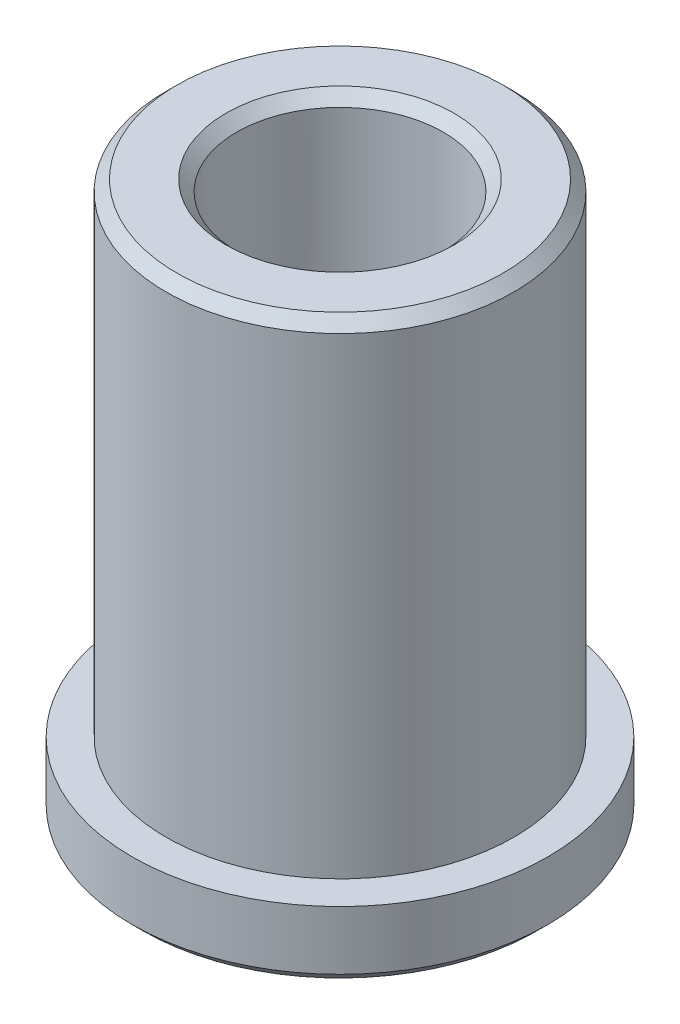
ISO-10303-21;
HEADER;
FILE_DESCRIPTION(('STEP AP214'),'2;1');
FILE_NAME('part.step','',(''),(''),'','','');
FILE_SCHEMA(('AUTOMOTIVE_DESIGN { 1 0 10303 214 1 1 1 1 }'));
ENDSEC;
DATA;
#1=APPLICATION_CONTEXT('core data for automotive mechanical design processes');
#2=APPLICATION_PROTOCOL_DEFINITION('international standard','automotive_design',2000,#1);
#3=PRODUCT_CONTEXT('',#1,'mechanical');
#4=PRODUCT('Part','Part','',(#3));
#5=PRODUCT_RELATED_PRODUCT_CATEGORY('part','',(#4));
#6=PRODUCT_DEFINITION_FORMATION('','',#4);
#7=PRODUCT_DEFINITION_CONTEXT('part definition',#1,'design');
#8=PRODUCT_DEFINITION('design','',#6,#7);
#9=PRODUCT_DEFINITION_SHAPE('','',#8);
#10=(LENGTH_UNIT() NAMED_UNIT(*) SI_UNIT(.MILLI.,.METRE.));
#11=(NAMED_UNIT(*) PLANE_ANGLE_UNIT() SI_UNIT($,.RADIAN.));
#12=(NAMED_UNIT(*) SI_UNIT($,.STERADIAN.) SOLID_ANGLE_UNIT());
#13=UNCERTAINTY_MEASURE_WITH_UNIT(LENGTH_MEASURE(1.E-05),#10,'distance_accuracy_value','');
#14=(GEOMETRIC_REPRESENTATION_CONTEXT(3) GLOBAL_UNCERTAINTY_ASSIGNED_CONTEXT((#13)) GLOBAL_UNIT_ASSIGNED_CONTEXT((#10,
#11,#12)) REPRESENTATION_CONTEXT('',''));
#15=CARTESIAN_POINT('',(0.,0.,0.));
#16=DIRECTION('',(0.,0.,1.));
#17=DIRECTION('',(1.,0.,0.));
#18=AXIS2_PLACEMENT_3D('',#15,#16,#17);
#19=CARTESIAN_POINT('',(-4.78,0.,0.));
#20=DIRECTION('',(0.,1.,0.));
#21=DIRECTION('',(0.,0.,1.));
#22=AXIS2_PLACEMENT_3D('',#19,#20,#21);
#23=PLANE('',#22);
#24=CARTESIAN_POINT('',(0.,0.,0.));
#25=DIRECTION('',(0.,1.,0.));
#26=DIRECTION('',(0.,0.,1.));
#27=AXIS2_PLACEMENT_3D('',#24,#25,#26);
#28=CIRCLE('',#27,2.62500000000001);
#29=CARTESIAN_POINT('',(0.,0.,2.62500000000001));
#30=VERTEX_POINT('',#29);
#31=EDGE_CURVE('E50',#30,#30,#28,.T.);
#32=ORIENTED_EDGE('',*,*,#31,.T.);
#33=EDGE_LOOP('',(#32));
#34=FACE_BOUND('',#33,.T.);
#35=CARTESIAN_POINT('',(0.,0.,0.));
#36=DIRECTION('',(0.,1.,0.));
#37=DIRECTION('',(0.,0.,1.));
#38=AXIS2_PLACEMENT_3D('',#35,#36,#37);
#39=CIRCLE('',#38,4.53);
#40=CARTESIAN_POINT('',(0.,0.,4.53));
#41=VERTEX_POINT('',#40);
#42=EDGE_CURVE('E53',#41,#41,#39,.F.);
#43=ORIENTED_EDGE('',*,*,#42,.T.);
#44=EDGE_LOOP('',(#43));
#45=FACE_BOUND('',#44,.T.);
#46=ADVANCED_FACE('F30',(#34,#45),#23,.F.);
#47=CARTESIAN_POINT('',(0.,0.,0.));
#48=DIRECTION('',(0.,-1.,0.));
#49=DIRECTION('',(0.,0.,-1.));
#50=AXIS2_PLACEMENT_3D('',#47,#48,#49);
#51=CYLINDRICAL_SURFACE('',#50,2.375);
#52=CARTESIAN_POINT('',(0.,0.250000000000002,0.));
#53=DIRECTION('',(0.,1.,0.));
#54=DIRECTION('',(0.,0.,1.));
#55=AXIS2_PLACEMENT_3D('',#52,#53,#54);
#56=CIRCLE('',#55,2.375);
#57=CARTESIAN_POINT('',(0.,0.250000000000002,2.375));
#58=VERTEX_POINT('',#57);
#59=EDGE_CURVE('E56',#58,#58,#56,.F.);
#60=ORIENTED_EDGE('',*,*,#59,.T.);
#61=EDGE_LOOP('',(#60));
#62=FACE_BOUND('',#61,.T.);
#63=CARTESIAN_POINT('',(0.,12.4625,0.));
#64=DIRECTION('',(0.,-1.,0.));
#65=DIRECTION('',(0.,0.,-1.));
#66=AXIS2_PLACEMENT_3D('',#63,#64,#65);
#67=CIRCLE('',#66,2.375);
#68=CARTESIAN_POINT('',(0.,12.4625,-2.375));
#69=VERTEX_POINT('',#68);
#70=EDGE_CURVE('E59',#69,#69,#67,.F.);
#71=ORIENTED_EDGE('',*,*,#70,.T.);
#72=EDGE_LOOP('',(#71));
#73=FACE_BOUND('',#72,.T.);
#74=ADVANCED_FACE('F84',(#62,#73),#51,.F.);
#75=CARTESIAN_POINT('',(-2.375,12.7125,0.));
#76=DIRECTION('',(0.,-1.,0.));
#77=DIRECTION('',(0.,0.,-1.));
#78=AXIS2_PLACEMENT_3D('',#75,#76,#77);
#79=PLANE('',#78);
#80=CARTESIAN_POINT('',(0.,12.7125,0.));
#81=DIRECTION('',(0.,-1.,0.));
#82=DIRECTION('',(0.,0.,-1.));
#83=AXIS2_PLACEMENT_3D('',#80,#81,#82);
#84=CIRCLE('',#83,2.625);
#85=CARTESIAN_POINT('',(0.,12.7125,-2.625));
#86=VERTEX_POINT('',#85);
#87=EDGE_CURVE('E41',#86,#86,#84,.T.);
#88=ORIENTED_EDGE('',*,*,#87,.T.);
#89=EDGE_LOOP('',(#88));
#90=FACE_BOUND('',#89,.T.);
#91=CARTESIAN_POINT('',(0.,12.7125,0.));
#92=DIRECTION('',(0.,-1.,0.));
#93=DIRECTION('',(0.,0.,-1.));
#94=AXIS2_PLACEMENT_3D('',#91,#92,#93);
#95=CIRCLE('',#94,3.75);
#96=CARTESIAN_POINT('',(0.,12.7125,-3.75));
#97=VERTEX_POINT('',#96);
#98=EDGE_CURVE('E45',#97,#97,#95,.F.);
#99=ORIENTED_EDGE('',*,*,#98,.T.);
#100=EDGE_LOOP('',(#99));
#101=FACE_BOUND('',#100,.T.);
#102=ADVANCED_FACE('F79',(#90,#101),#79,.F.);
#103=CARTESIAN_POINT('',(0.,0.,0.));
#104=DIRECTION('',(0.,-1.,0.));
#105=DIRECTION('',(0.,0.,-1.));
#106=AXIS2_PLACEMENT_3D('',#103,#104,#105);
#107=CYLINDRICAL_SURFACE('',#106,4.);
#108=CARTESIAN_POINT('',(0.,12.4625,0.));
#109=DIRECTION('',(0.,-1.,0.));
#110=DIRECTION('',(0.,0.,-1.));
#111=AXIS2_PLACEMENT_3D('',#108,#109,#110);
#112=CIRCLE('',#111,4.);
#113=CARTESIAN_POINT('',(0.,12.4625,-4.));
#114=VERTEX_POINT('',#113);
#115=EDGE_CURVE('E37',#114,#114,#112,.T.);
#116=ORIENTED_EDGE('',*,*,#115,.T.);
#117=EDGE_LOOP('',(#116));
#118=FACE_BOUND('',#117,.T.);
#119=CARTESIAN_POINT('',(0.,1.6,0.));
#120=DIRECTION('',(0.,-1.,0.));
#121=DIRECTION('',(0.,0.,-1.));
#122=AXIS2_PLACEMENT_3D('',#119,#120,#121);
#123=CIRCLE('',#122,4.);
#124=CARTESIAN_POINT('',(0.,1.6,-4.));
#125=VERTEX_POINT('',#124);
#126=EDGE_CURVE('E62',#125,#125,#123,.T.);
#127=ORIENTED_EDGE('',*,*,#126,.F.);
#128=EDGE_LOOP('',(#127));
#129=FACE_BOUND('',#128,.T.);
#130=ADVANCED_FACE('F74',(#118,#129),#107,.T.);
#131=CARTESIAN_POINT('',(-4.,1.6,0.));
#132=DIRECTION('',(0.,-1.,0.));
#133=DIRECTION('',(0.,0.,-1.));
#134=AXIS2_PLACEMENT_3D('',#131,#132,#133);
#135=PLANE('',#134);
#136=CARTESIAN_POINT('',(0.,1.6,0.));
#137=DIRECTION('',(0.,-1.,0.));
#138=DIRECTION('',(0.,0.,-1.));
#139=AXIS2_PLACEMENT_3D('',#136,#137,#138);
#140=CIRCLE('',#139,4.78);
#141=CARTESIAN_POINT('',(0.,1.6,-4.78));
#142=VERTEX_POINT('',#141);
#143=EDGE_CURVE('E65',#142,#142,#140,.T.);
#144=ORIENTED_EDGE('',*,*,#143,.F.);
#145=EDGE_LOOP('',(#144));
#146=FACE_BOUND('',#145,.T.);
#147=ORIENTED_EDGE('',*,*,#126,.T.);
#148=EDGE_LOOP('',(#147));
#149=FACE_BOUND('',#148,.T.);
#150=ADVANCED_FACE('F71',(#146,#149),#135,.F.);
#151=CARTESIAN_POINT('',(0.,0.,0.));
#152=DIRECTION('',(0.,-1.,0.));
#153=DIRECTION('',(0.,0.,-1.));
#154=AXIS2_PLACEMENT_3D('',#151,#152,#153);
#155=CYLINDRICAL_SURFACE('',#154,4.78);
#156=CARTESIAN_POINT('',(0.,0.249999999999999,0.));
#157=DIRECTION('',(0.,1.,0.));
#158=DIRECTION('',(0.,0.,1.));
#159=AXIS2_PLACEMENT_3D('',#156,#157,#158);
#160=CIRCLE('',#159,4.78);
#161=CARTESIAN_POINT('',(0.,0.249999999999999,4.78));
#162=VERTEX_POINT('',#161);
#163=EDGE_CURVE('E10',#162,#162,#160,.T.);
#164=ORIENTED_EDGE('',*,*,#163,.T.);
#165=EDGE_LOOP('',(#164));
#166=FACE_BOUND('',#165,.T.);
#167=ORIENTED_EDGE('',*,*,#143,.T.);
#168=EDGE_LOOP('',(#167));
#169=FACE_BOUND('',#168,.T.);
#170=ADVANCED_FACE('F69',(#166,#169),#155,.T.);
#171=CARTESIAN_POINT('',(0.,0.250000000000002,0.));
#172=DIRECTION('',(0.,-1.,0.));
#173=DIRECTION('',(0.,0.,-1.));
#174=AXIS2_PLACEMENT_3D('',#171,#172,#173);
#175=CONICAL_SURFACE('',#174,2.375,0.785398163397453);
#176=ORIENTED_EDGE('',*,*,#31,.F.);
#177=EDGE_LOOP('',(#176));
#178=FACE_BOUND('',#177,.T.);
#179=ORIENTED_EDGE('',*,*,#59,.F.);
#180=EDGE_LOOP('',(#179));
#181=FACE_BOUND('',#180,.T.);
#182=ADVANCED_FACE('F97',(#178,#181),#175,.F.);
#183=CARTESIAN_POINT('',(0.,12.7125,0.));
#184=DIRECTION('',(0.,1.,0.));
#185=DIRECTION('',(0.,0.,1.));
#186=AXIS2_PLACEMENT_3D('',#183,#184,#185);
#187=CONICAL_SURFACE('',#186,2.625,0.785398163397447);
#188=ORIENTED_EDGE('',*,*,#70,.F.);
#189=EDGE_LOOP('',(#188));
#190=FACE_BOUND('',#189,.T.);
#191=ORIENTED_EDGE('',*,*,#87,.F.);
#192=EDGE_LOOP('',(#191));
#193=FACE_BOUND('',#192,.T.);
#194=ADVANCED_FACE('F100',(#190,#193),#187,.F.);
#195=CARTESIAN_POINT('',(0.,12.4625,0.));
#196=DIRECTION('',(0.,-1.,0.));
#197=DIRECTION('',(0.,0.,-1.));
#198=AXIS2_PLACEMENT_3D('',#195,#196,#197);
#199=CONICAL_SURFACE('',#198,4.,0.785398163397459);
#200=ORIENTED_EDGE('',*,*,#98,.F.);
#201=EDGE_LOOP('',(#200));
#202=FACE_BOUND('',#201,.T.);
#203=ORIENTED_EDGE('',*,*,#115,.F.);
#204=EDGE_LOOP('',(#203));
#205=FACE_BOUND('',#204,.T.);
#206=ADVANCED_FACE('F103',(#202,#205),#199,.T.);
#207=CARTESIAN_POINT('',(0.,0.,0.));
#208=DIRECTION('',(0.,1.,0.));
#209=DIRECTION('',(0.,0.,1.));
#210=AXIS2_PLACEMENT_3D('',#207,#208,#209);
#211=CONICAL_SURFACE('',#210,4.53,0.785398163397447);
#212=ORIENTED_EDGE('',*,*,#163,.F.);
#213=EDGE_LOOP('',(#212));
#214=FACE_BOUND('',#213,.T.);
#215=ORIENTED_EDGE('',*,*,#42,.F.);
#216=EDGE_LOOP('',(#215));
#217=FACE_BOUND('',#216,.T.);
#218=ADVANCED_FACE('F32',(#214,#217),#211,.T.);
#219=CLOSED_SHELL('',(#46,#74,#102,#130,#150,#170,#182,#194,#206,#218));
#220=MANIFOLD_SOLID_BREP('B2',#219);
#221=ADVANCED_BREP_SHAPE_REPRESENTATION('',(#18,#220),#14);
#222=SHAPE_DEFINITION_REPRESENTATION(#9,#221);
ENDSEC;
END-ISO-10303-21;
